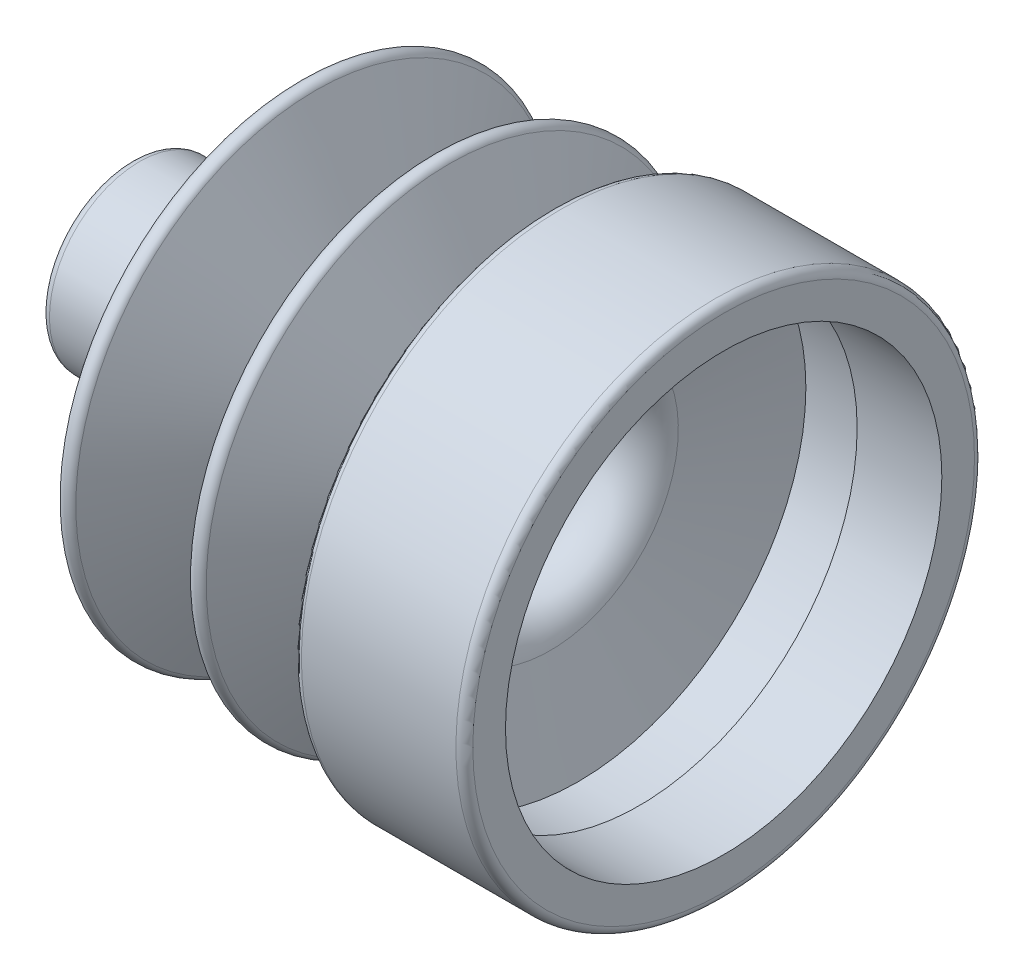
ISO-10303-21;
HEADER;
FILE_DESCRIPTION(('STEP AP214'),'2;1');
FILE_NAME('part.step','',(''),(''),'','','');
FILE_SCHEMA(('AUTOMOTIVE_DESIGN { 1 0 10303 214 1 1 1 1 }'));
ENDSEC;
DATA;
#1=APPLICATION_CONTEXT('core data for automotive mechanical design processes');
#2=APPLICATION_PROTOCOL_DEFINITION('international standard','automotive_design',2000,#1);
#3=PRODUCT_CONTEXT('',#1,'mechanical');
#4=PRODUCT('Part','Part','',(#3));
#5=PRODUCT_RELATED_PRODUCT_CATEGORY('part','',(#4));
#6=PRODUCT_DEFINITION_FORMATION('','',#4);
#7=PRODUCT_DEFINITION_CONTEXT('part definition',#1,'design');
#8=PRODUCT_DEFINITION('design','',#6,#7);
#9=PRODUCT_DEFINITION_SHAPE('','',#8);
#10=(LENGTH_UNIT() NAMED_UNIT(*) SI_UNIT(.MILLI.,.METRE.));
#11=(NAMED_UNIT(*) PLANE_ANGLE_UNIT() SI_UNIT($,.RADIAN.));
#12=(NAMED_UNIT(*) SI_UNIT($,.STERADIAN.) SOLID_ANGLE_UNIT());
#13=UNCERTAINTY_MEASURE_WITH_UNIT(LENGTH_MEASURE(1.E-05),#10,'distance_accuracy_value','');
#14=(GEOMETRIC_REPRESENTATION_CONTEXT(3) GLOBAL_UNCERTAINTY_ASSIGNED_CONTEXT((#13)) GLOBAL_UNIT_ASSIGNED_CONTEXT((#10,
#11,#12)) REPRESENTATION_CONTEXT('',''));
#15=CARTESIAN_POINT('',(0.,0.,0.));
#16=DIRECTION('',(0.,0.,1.));
#17=DIRECTION('',(1.,0.,0.));
#18=AXIS2_PLACEMENT_3D('',#15,#16,#17);
#19=CARTESIAN_POINT('',(-44.45,6.111875,0.));
#20=DIRECTION('',(-1.,0.,0.));
#21=DIRECTION('',(0.,-1.,0.));
#22=AXIS2_PLACEMENT_3D('',#19,#20,#21);
#23=PLANE('',#22);
#24=CARTESIAN_POINT('',(-44.45,0.,0.));
#25=DIRECTION('',(-1.,0.,0.));
#26=DIRECTION('',(0.,-1.,0.));
#27=AXIS2_PLACEMENT_3D('',#24,#25,#26);
#28=CIRCLE('',#27,3.96875);
#29=CARTESIAN_POINT('',(-44.45,-3.96875,0.));
#30=VERTEX_POINT('',#29);
#31=EDGE_CURVE('E132',#30,#30,#28,.T.);
#32=ORIENTED_EDGE('',*,*,#31,.F.);
#33=EDGE_LOOP('',(#32));
#34=FACE_BOUND('',#33,.T.);
#35=CARTESIAN_POINT('',(-44.45,0.,0.));
#36=DIRECTION('',(1.,0.,0.));
#37=DIRECTION('',(0.,1.,0.));
#38=AXIS2_PLACEMENT_3D('',#35,#36,#37);
#39=CIRCLE('',#38,6.111875);
#40=CARTESIAN_POINT('',(-44.45,6.111875,0.));
#41=VERTEX_POINT('',#40);
#42=EDGE_CURVE('E41',#41,#41,#39,.T.);
#43=ORIENTED_EDGE('',*,*,#42,.F.);
#44=EDGE_LOOP('',(#43));
#45=FACE_BOUND('',#44,.T.);
#46=ADVANCED_FACE('F35',(#34,#45),#23,.T.);
#47=CARTESIAN_POINT('',(-43.815,0.,0.));
#48=DIRECTION('',(1.,0.,0.));
#49=DIRECTION('',(0.,1.,0.));
#50=AXIS2_PLACEMENT_3D('',#47,#48,#49);
#51=TOROIDAL_SURFACE('',#50,6.111875,0.634999999999999);
#52=ORIENTED_EDGE('',*,*,#42,.T.);
#53=EDGE_LOOP('',(#52));
#54=FACE_BOUND('',#53,.T.);
#55=CARTESIAN_POINT('',(-43.815,0.,0.));
#56=DIRECTION('',(1.,0.,0.));
#57=DIRECTION('',(0.,1.,0.));
#58=AXIS2_PLACEMENT_3D('',#55,#56,#57);
#59=CIRCLE('',#58,6.746875);
#60=CARTESIAN_POINT('',(-43.815,6.746875,0.));
#61=VERTEX_POINT('',#60);
#62=EDGE_CURVE('E45',#61,#61,#59,.T.);
#63=ORIENTED_EDGE('',*,*,#62,.F.);
#64=EDGE_LOOP('',(#63));
#65=FACE_BOUND('',#64,.T.);
#66=ADVANCED_FACE('F141',(#54,#65),#51,.T.);
#67=CARTESIAN_POINT('',(0.,0.,0.));
#68=DIRECTION('',(1.,0.,0.));
#69=DIRECTION('',(0.,1.,0.));
#70=AXIS2_PLACEMENT_3D('',#67,#68,#69);
#71=CYLINDRICAL_SURFACE('',#70,6.746875);
#72=ORIENTED_EDGE('',*,*,#62,.T.);
#73=EDGE_LOOP('',(#72));
#74=FACE_BOUND('',#73,.T.);
#75=CARTESIAN_POINT('',(-35.4052001738296,0.,0.));
#76=DIRECTION('',(1.,0.,0.));
#77=DIRECTION('',(0.,1.,0.));
#78=AXIS2_PLACEMENT_3D('',#75,#76,#77);
#79=CIRCLE('',#78,6.746875);
#80=CARTESIAN_POINT('',(-35.4052001738296,6.746875,0.));
#81=VERTEX_POINT('',#80);
#82=EDGE_CURVE('E49',#81,#81,#79,.T.);
#83=ORIENTED_EDGE('',*,*,#82,.F.);
#84=EDGE_LOOP('',(#83));
#85=FACE_BOUND('',#84,.T.);
#86=ADVANCED_FACE('F147',(#74,#85),#71,.T.);
#87=CARTESIAN_POINT('',(-35.4052001738296,0.,0.));
#88=DIRECTION('',(1.,0.,0.));
#89=DIRECTION('',(0.,1.,0.));
#90=AXIS2_PLACEMENT_3D('',#87,#88,#89);
#91=TOROIDAL_SURFACE('',#90,7.381875,0.635000000000003);
#92=ORIENTED_EDGE('',*,*,#82,.T.);
#93=EDGE_LOOP('',(#92));
#94=FACE_BOUND('',#93,.T.);
#95=CARTESIAN_POINT('',(-34.7942078783524,0.,0.));
#96=DIRECTION('',(1.,0.,0.));
#97=DIRECTION('',(0.,1.,0.));
#98=AXIS2_PLACEMENT_3D('',#95,#96,#97);
#99=CIRCLE('',#98,7.20892004960113);
#100=CARTESIAN_POINT('',(-34.7942078783524,7.20892004960113,0.));
#101=VERTEX_POINT('',#100);
#102=EDGE_CURVE('E54',#101,#101,#99,.T.);
#103=ORIENTED_EDGE('',*,*,#102,.F.);
#104=EDGE_LOOP('',(#103));
#105=FACE_BOUND('',#104,.T.);
#106=ADVANCED_FACE('F151',(#94,#105),#91,.F.);
#107=CARTESIAN_POINT('',(-31.7742982560787,0.,0.));
#108=DIRECTION('',(1.,0.,0.));
#109=DIRECTION('',(0.,1.,0.));
#110=AXIS2_PLACEMENT_3D('',#107,#108,#109);
#111=CONICAL_SURFACE('',#110,17.8772559832736,1.2949410259382);
#112=ORIENTED_EDGE('',*,*,#102,.T.);
#113=EDGE_LOOP('',(#112));
#114=FACE_BOUND('',#113,.T.);
#115=CARTESIAN_POINT('',(-31.7742982560787,0.,0.));
#116=DIRECTION('',(1.,0.,0.));
#117=DIRECTION('',(0.,1.,0.));
#118=AXIS2_PLACEMENT_3D('',#115,#116,#117);
#119=CIRCLE('',#118,17.8772559832736);
#120=CARTESIAN_POINT('',(-31.7742982560787,17.8772559832736,0.));
#121=VERTEX_POINT('',#120);
#122=EDGE_CURVE('E57',#121,#121,#119,.T.);
#123=ORIENTED_EDGE('',*,*,#122,.F.);
#124=EDGE_LOOP('',(#123));
#125=FACE_BOUND('',#124,.T.);
#126=ADVANCED_FACE('F158',(#114,#125),#111,.T.);
#127=CARTESIAN_POINT('',(-31.1633059606015,0.,0.));
#128=DIRECTION('',(1.,0.,0.));
#129=DIRECTION('',(0.,1.,0.));
#130=AXIS2_PLACEMENT_3D('',#127,#128,#129);
#131=TOROIDAL_SURFACE('',#130,17.7043010328748,0.634999999999999);
#132=ORIENTED_EDGE('',*,*,#122,.T.);
#133=EDGE_LOOP('',(#132));
#134=FACE_BOUND('',#133,.T.);
#135=CARTESIAN_POINT('',(-30.5961783253455,0.,0.));
#136=DIRECTION('',(1.,0.,0.));
#137=DIRECTION('',(0.,1.,0.));
#138=AXIS2_PLACEMENT_3D('',#135,#136,#137);
#139=CIRCLE('',#138,17.9899428458659);
#140=CARTESIAN_POINT('',(-30.5961783253455,17.9899428458659,0.));
#141=VERTEX_POINT('',#140);
#142=EDGE_CURVE('E60',#141,#141,#139,.T.);
#143=ORIENTED_EDGE('',*,*,#142,.F.);
#144=EDGE_LOOP('',(#143));
#145=FACE_BOUND('',#144,.T.);
#146=ADVANCED_FACE('F162',(#134,#145),#131,.T.);
#147=CARTESIAN_POINT('',(-26.5166095683057,0.,0.));
#148=DIRECTION('',(-1.,0.,0.));
#149=DIRECTION('',(0.,-1.,0.));
#150=AXIS2_PLACEMENT_3D('',#147,#148,#149);
#151=CONICAL_SURFACE('',#150,9.89016166251453,1.104221759984);
#152=ORIENTED_EDGE('',*,*,#142,.T.);
#153=EDGE_LOOP('',(#152));
#154=FACE_BOUND('',#153,.T.);
#155=CARTESIAN_POINT('',(-26.5166095683057,0.,0.));
#156=DIRECTION('',(1.,0.,0.));
#157=DIRECTION('',(0.,1.,0.));
#158=AXIS2_PLACEMENT_3D('',#155,#156,#157);
#159=CIRCLE('',#158,9.89016166251453);
#160=CARTESIAN_POINT('',(-26.5166095683057,9.89016166251453,0.));
#161=VERTEX_POINT('',#160);
#162=EDGE_CURVE('E63',#161,#161,#159,.T.);
#163=ORIENTED_EDGE('',*,*,#162,.F.);
#164=EDGE_LOOP('',(#163));
#165=FACE_BOUND('',#164,.T.);
#166=ADVANCED_FACE('F166',(#154,#165),#151,.T.);
#167=CARTESIAN_POINT('',(-25.9494819330497,0.,0.));
#168=DIRECTION('',(1.,0.,0.));
#169=DIRECTION('',(0.,1.,0.));
#170=AXIS2_PLACEMENT_3D('',#167,#168,#169);
#171=TOROIDAL_SURFACE('',#170,10.1758034755057,0.634999999999999);
#172=ORIENTED_EDGE('',*,*,#162,.T.);
#173=EDGE_LOOP('',(#172));
#174=FACE_BOUND('',#173,.T.);
#175=CARTESIAN_POINT('',(-25.3685451990316,0.,0.));
#176=DIRECTION('',(1.,0.,0.));
#177=DIRECTION('',(0.,1.,0.));
#178=AXIS2_PLACEMENT_3D('',#175,#176,#177);
#179=CIRCLE('',#178,9.91941020127948);
#180=CARTESIAN_POINT('',(-25.3685451990316,9.91941020127948,0.));
#181=VERTEX_POINT('',#180);
#182=EDGE_CURVE('E66',#181,#181,#179,.T.);
#183=ORIENTED_EDGE('',*,*,#182,.F.);
#184=EDGE_LOOP('',(#183));
#185=FACE_BOUND('',#184,.T.);
#186=ADVANCED_FACE('F170',(#174,#185),#171,.F.);
#187=CARTESIAN_POINT('',(-21.7067073886102,0.,0.));
#188=DIRECTION('',(1.,0.,0.));
#189=DIRECTION('',(0.,1.,0.));
#190=AXIS2_PLACEMENT_3D('',#187,#188,#189);
#191=CONICAL_SURFACE('',#190,18.2164144987206,1.15516352618213);
#192=ORIENTED_EDGE('',*,*,#182,.T.);
#193=EDGE_LOOP('',(#192));
#194=FACE_BOUND('',#193,.T.);
#195=CARTESIAN_POINT('',(-21.7067073886102,0.,0.));
#196=DIRECTION('',(1.,0.,0.));
#197=DIRECTION('',(0.,1.,0.));
#198=AXIS2_PLACEMENT_3D('',#195,#196,#197);
#199=CIRCLE('',#198,18.2164144987206);
#200=CARTESIAN_POINT('',(-21.7067073886102,18.2164144987206,0.));
#201=VERTEX_POINT('',#200);
#202=EDGE_CURVE('E69',#201,#201,#199,.T.);
#203=ORIENTED_EDGE('',*,*,#202,.F.);
#204=EDGE_LOOP('',(#203));
#205=FACE_BOUND('',#204,.T.);
#206=ADVANCED_FACE('F174',(#194,#205),#191,.T.);
#207=CARTESIAN_POINT('',(-21.1257706545921,0.,0.));
#208=DIRECTION('',(1.,0.,0.));
#209=DIRECTION('',(0.,1.,0.));
#210=AXIS2_PLACEMENT_3D('',#207,#208,#209);
#211=TOROIDAL_SURFACE('',#210,17.9600212244944,0.634999999999999);
#212=ORIENTED_EDGE('',*,*,#202,.T.);
#213=EDGE_LOOP('',(#212));
#214=FACE_BOUND('',#213,.T.);
#215=CARTESIAN_POINT('',(-20.5586430193361,0.,0.));
#216=DIRECTION('',(1.,0.,0.));
#217=DIRECTION('',(0.,1.,0.));
#218=AXIS2_PLACEMENT_3D('',#215,#216,#217);
#219=CIRCLE('',#218,18.2456630374855);
#220=CARTESIAN_POINT('',(-20.5586430193361,18.2456630374855,0.));
#221=VERTEX_POINT('',#220);
#222=EDGE_CURVE('E72',#221,#221,#219,.T.);
#223=ORIENTED_EDGE('',*,*,#222,.F.);
#224=EDGE_LOOP('',(#223));
#225=FACE_BOUND('',#224,.T.);
#226=ADVANCED_FACE('F178',(#214,#225),#211,.T.);
#227=CARTESIAN_POINT('',(-16.4790742622963,0.,0.));
#228=DIRECTION('',(-1.,0.,0.));
#229=DIRECTION('',(0.,-1.,0.));
#230=AXIS2_PLACEMENT_3D('',#227,#228,#229);
#231=CONICAL_SURFACE('',#230,10.1458818541341,1.104221759984);
#232=ORIENTED_EDGE('',*,*,#222,.T.);
#233=EDGE_LOOP('',(#232));
#234=FACE_BOUND('',#233,.T.);
#235=CARTESIAN_POINT('',(-16.4790742622963,0.,0.));
#236=DIRECTION('',(1.,0.,0.));
#237=DIRECTION('',(0.,1.,0.));
#238=AXIS2_PLACEMENT_3D('',#235,#236,#237);
#239=CIRCLE('',#238,10.1458818541341);
#240=CARTESIAN_POINT('',(-16.4790742622963,10.1458818541341,0.));
#241=VERTEX_POINT('',#240);
#242=EDGE_CURVE('E75',#241,#241,#239,.T.);
#243=ORIENTED_EDGE('',*,*,#242,.F.);
#244=EDGE_LOOP('',(#243));
#245=FACE_BOUND('',#244,.T.);
#246=ADVANCED_FACE('F182',(#234,#245),#231,.T.);
#247=CARTESIAN_POINT('',(-15.9119466270403,0.,0.));
#248=DIRECTION('',(1.,0.,0.));
#249=DIRECTION('',(0.,1.,0.));
#250=AXIS2_PLACEMENT_3D('',#247,#248,#249);
#251=TOROIDAL_SURFACE('',#250,10.4315236671253,0.635);
#252=ORIENTED_EDGE('',*,*,#242,.T.);
#253=EDGE_LOOP('',(#252));
#254=FACE_BOUND('',#253,.T.);
#255=CARTESIAN_POINT('',(-15.3009543315631,0.,0.));
#256=DIRECTION('',(1.,0.,0.));
#257=DIRECTION('',(0.,1.,0.));
#258=AXIS2_PLACEMENT_3D('',#255,#256,#257);
#259=CIRCLE('',#258,10.2585687167264);
#260=CARTESIAN_POINT('',(-15.3009543315631,10.2585687167264,0.));
#261=VERTEX_POINT('',#260);
#262=EDGE_CURVE('E78',#261,#261,#259,.T.);
#263=ORIENTED_EDGE('',*,*,#262,.F.);
#264=EDGE_LOOP('',(#263));
#265=FACE_BOUND('',#264,.T.);
#266=ADVANCED_FACE('F186',(#254,#265),#251,.F.);
#267=CARTESIAN_POINT('',(-12.8307921216476,0.,0.));
#268=DIRECTION('',(1.,0.,0.));
#269=DIRECTION('',(0.,1.,0.));
#270=AXIS2_PLACEMENT_3D('',#267,#268,#269);
#271=CONICAL_SURFACE('',#270,18.9848299503989,1.2949410259382);
#272=ORIENTED_EDGE('',*,*,#262,.T.);
#273=EDGE_LOOP('',(#272));
#274=FACE_BOUND('',#273,.T.);
#275=CARTESIAN_POINT('',(-12.8307921216476,0.,0.));
#276=DIRECTION('',(1.,0.,0.));
#277=DIRECTION('',(0.,1.,0.));
#278=AXIS2_PLACEMENT_3D('',#275,#276,#277);
#279=CIRCLE('',#278,18.9848299503989);
#280=CARTESIAN_POINT('',(-12.8307921216476,18.9848299503989,0.));
#281=VERTEX_POINT('',#280);
#282=EDGE_CURVE('E81',#281,#281,#279,.T.);
#283=ORIENTED_EDGE('',*,*,#282,.F.);
#284=EDGE_LOOP('',(#283));
#285=FACE_BOUND('',#284,.T.);
#286=ADVANCED_FACE('F190',(#274,#285),#271,.T.);
#287=CARTESIAN_POINT('',(-12.2197998261704,0.,0.));
#288=DIRECTION('',(1.,0.,0.));
#289=DIRECTION('',(0.,1.,0.));
#290=AXIS2_PLACEMENT_3D('',#287,#288,#289);
#291=TOROIDAL_SURFACE('',#290,18.811875,0.635);
#292=ORIENTED_EDGE('',*,*,#282,.T.);
#293=EDGE_LOOP('',(#292));
#294=FACE_BOUND('',#293,.T.);
#295=CARTESIAN_POINT('',(-12.2197998261704,0.,0.));
#296=DIRECTION('',(1.,0.,0.));
#297=DIRECTION('',(0.,1.,0.));
#298=AXIS2_PLACEMENT_3D('',#295,#296,#297);
#299=CIRCLE('',#298,19.446875);
#300=CARTESIAN_POINT('',(-12.2197998261704,19.446875,0.));
#301=VERTEX_POINT('',#300);
#302=EDGE_CURVE('E84',#301,#301,#299,.T.);
#303=ORIENTED_EDGE('',*,*,#302,.F.);
#304=EDGE_LOOP('',(#303));
#305=FACE_BOUND('',#304,.T.);
#306=ADVANCED_FACE('F194',(#294,#305),#291,.T.);
#307=CARTESIAN_POINT('',(0.,0.,0.));
#308=DIRECTION('',(1.,0.,0.));
#309=DIRECTION('',(0.,1.,0.));
#310=AXIS2_PLACEMENT_3D('',#307,#308,#309);
#311=CYLINDRICAL_SURFACE('',#310,19.446875);
#312=ORIENTED_EDGE('',*,*,#302,.T.);
#313=EDGE_LOOP('',(#312));
#314=FACE_BOUND('',#313,.T.);
#315=CARTESIAN_POINT('',(-0.635000000000004,0.,0.));
#316=DIRECTION('',(1.,0.,0.));
#317=DIRECTION('',(0.,1.,0.));
#318=AXIS2_PLACEMENT_3D('',#315,#316,#317);
#319=CIRCLE('',#318,19.446875);
#320=CARTESIAN_POINT('',(-0.635000000000004,19.446875,0.));
#321=VERTEX_POINT('',#320);
#322=EDGE_CURVE('E87',#321,#321,#319,.T.);
#323=ORIENTED_EDGE('',*,*,#322,.F.);
#324=EDGE_LOOP('',(#323));
#325=FACE_BOUND('',#324,.T.);
#326=ADVANCED_FACE('F198',(#314,#325),#311,.T.);
#327=CARTESIAN_POINT('',(-0.635,0.,0.));
#328=DIRECTION('',(1.,0.,0.));
#329=DIRECTION('',(0.,1.,0.));
#330=AXIS2_PLACEMENT_3D('',#327,#328,#329);
#331=TOROIDAL_SURFACE('',#330,18.811875,0.635);
#332=ORIENTED_EDGE('',*,*,#322,.T.);
#333=EDGE_LOOP('',(#332));
#334=FACE_BOUND('',#333,.T.);
#335=CARTESIAN_POINT('',(0.,0.,0.));
#336=DIRECTION('',(1.,0.,0.));
#337=DIRECTION('',(0.,1.,0.));
#338=AXIS2_PLACEMENT_3D('',#335,#336,#337);
#339=CIRCLE('',#338,18.811875);
#340=CARTESIAN_POINT('',(0.,18.811875,0.));
#341=VERTEX_POINT('',#340);
#342=EDGE_CURVE('E90',#341,#341,#339,.T.);
#343=ORIENTED_EDGE('',*,*,#342,.F.);
#344=EDGE_LOOP('',(#343));
#345=FACE_BOUND('',#344,.T.);
#346=ADVANCED_FACE('F202',(#334,#345),#331,.T.);
#347=CARTESIAN_POINT('',(0.,0.,0.));
#348=DIRECTION('',(1.,0.,0.));
#349=DIRECTION('',(0.,1.,0.));
#350=AXIS2_PLACEMENT_3D('',#347,#348,#349);
#351=PLANE('',#350);
#352=CARTESIAN_POINT('',(0.,0.,0.));
#353=DIRECTION('',(-1.,0.,0.));
#354=DIRECTION('',(0.,0.,1.));
#355=AXIS2_PLACEMENT_3D('',#352,#353,#354);
#356=CIRCLE('',#355,16.3626239198968);
#357=CARTESIAN_POINT('',(0.,0.,16.3626239198968));
#358=VERTEX_POINT('',#357);
#359=EDGE_CURVE('E98',#358,#358,#356,.T.);
#360=ORIENTED_EDGE('',*,*,#359,.T.);
#361=EDGE_LOOP('',(#360));
#362=FACE_BOUND('',#361,.T.);
#363=ORIENTED_EDGE('',*,*,#342,.T.);
#364=EDGE_LOOP('',(#363));
#365=FACE_BOUND('',#364,.T.);
#366=ADVANCED_FACE('F206',(#362,#365),#351,.T.);
#367=CARTESIAN_POINT('',(-6.35,17.1563739198968,0.));
#368=DIRECTION('',(1.,0.,0.));
#369=DIRECTION('',(0.,0.,-1.));
#370=AXIS2_PLACEMENT_3D('',#367,#368,#369);
#371=PLANE('',#370);
#372=CARTESIAN_POINT('',(-6.35,0.,0.));
#373=DIRECTION('',(-1.,0.,0.));
#374=DIRECTION('',(0.,0.,1.));
#375=AXIS2_PLACEMENT_3D('',#372,#373,#374);
#376=CIRCLE('',#375,16.3626239198968);
#377=CARTESIAN_POINT('',(-6.35,0.,16.3626239198968));
#378=VERTEX_POINT('',#377);
#379=EDGE_CURVE('E126',#378,#378,#376,.T.);
#380=ORIENTED_EDGE('',*,*,#379,.F.);
#381=EDGE_LOOP('',(#380));
#382=FACE_BOUND('',#381,.T.);
#383=CARTESIAN_POINT('',(-6.35,0.,0.));
#384=DIRECTION('',(1.,0.,0.));
#385=DIRECTION('',(0.,0.,-1.));
#386=AXIS2_PLACEMENT_3D('',#383,#384,#385);
#387=CIRCLE('',#386,17.065625);
#388=CARTESIAN_POINT('',(-6.35,0.,-17.065625));
#389=VERTEX_POINT('',#388);
#390=EDGE_CURVE('E10',#389,#389,#387,.F.);
#391=ORIENTED_EDGE('',*,*,#390,.T.);
#392=EDGE_LOOP('',(#391));
#393=FACE_BOUND('',#392,.T.);
#394=ADVANCED_FACE('F210',(#382,#393),#371,.F.);
#395=CARTESIAN_POINT('',(-56.5582404126489,0.,0.));
#396=DIRECTION('',(-1.,0.,0.));
#397=DIRECTION('',(0.,0.,1.));
#398=AXIS2_PLACEMENT_3D('',#395,#396,#397);
#399=CYLINDRICAL_SURFACE('',#398,16.3626239198968);
#400=ORIENTED_EDGE('',*,*,#359,.F.);
#401=EDGE_LOOP('',(#400));
#402=FACE_BOUND('',#401,.T.);
#403=ORIENTED_EDGE('',*,*,#379,.T.);
#404=EDGE_LOOP('',(#403));
#405=FACE_BOUND('',#404,.T.);
#406=ADVANCED_FACE('F253',(#402,#405),#399,.F.);
#407=CARTESIAN_POINT('',(-42.06875,6.111875,0.));
#408=DIRECTION('',(-1.,0.,0.));
#409=DIRECTION('',(0.,-1.,0.));
#410=AXIS2_PLACEMENT_3D('',#407,#408,#409);
#411=PLANE('',#410);
#412=CARTESIAN_POINT('',(-42.06875,0.,0.));
#413=DIRECTION('',(-1.,0.,0.));
#414=DIRECTION('',(0.,-1.,0.));
#415=AXIS2_PLACEMENT_3D('',#412,#413,#414);
#416=CIRCLE('',#415,3.96875);
#417=CARTESIAN_POINT('',(-42.06875,-3.96875,0.));
#418=VERTEX_POINT('',#417);
#419=EDGE_CURVE('E129',#418,#418,#416,.F.);
#420=ORIENTED_EDGE('',*,*,#419,.F.);
#421=EDGE_LOOP('',(#420));
#422=FACE_BOUND('',#421,.T.);
#423=CARTESIAN_POINT('',(-42.06875,0.,0.));
#424=DIRECTION('',(-1.,0.,0.));
#425=DIRECTION('',(0.,-1.,0.));
#426=AXIS2_PLACEMENT_3D('',#423,#424,#425);
#427=CIRCLE('',#426,4.365625);
#428=CARTESIAN_POINT('',(-42.06875,-4.365625,0.));
#429=VERTEX_POINT('',#428);
#430=EDGE_CURVE('E93',#429,#429,#427,.F.);
#431=ORIENTED_EDGE('',*,*,#430,.T.);
#432=EDGE_LOOP('',(#431));
#433=FACE_BOUND('',#432,.T.);
#434=ADVANCED_FACE('F250',(#422,#433),#411,.F.);
#435=CARTESIAN_POINT('',(0.,0.,0.));
#436=DIRECTION('',(1.,0.,0.));
#437=DIRECTION('',(0.,1.,0.));
#438=AXIS2_PLACEMENT_3D('',#435,#436,#437);
#439=CYLINDRICAL_SURFACE('',#438,4.365625);
#440=ORIENTED_EDGE('',*,*,#430,.F.);
#441=EDGE_LOOP('',(#440));
#442=FACE_BOUND('',#441,.T.);
#443=CARTESIAN_POINT('',(-35.4052001738296,0.,0.));
#444=DIRECTION('',(1.,0.,0.));
#445=DIRECTION('',(0.,1.,0.));
#446=AXIS2_PLACEMENT_3D('',#443,#444,#445);
#447=CIRCLE('',#446,4.365625);
#448=CARTESIAN_POINT('',(-35.4052001738296,4.365625,0.));
#449=VERTEX_POINT('',#448);
#450=EDGE_CURVE('E119',#449,#449,#447,.T.);
#451=ORIENTED_EDGE('',*,*,#450,.T.);
#452=EDGE_LOOP('',(#451));
#453=FACE_BOUND('',#452,.T.);
#454=ADVANCED_FACE('F246',(#442,#453),#439,.F.);
#455=CARTESIAN_POINT('',(-35.4052001738296,0.,0.));
#456=DIRECTION('',(1.,0.,0.));
#457=DIRECTION('',(0.,1.,0.));
#458=AXIS2_PLACEMENT_3D('',#455,#456,#457);
#459=TOROIDAL_SURFACE('',#458,7.381875,3.01625);
#460=ORIENTED_EDGE('',*,*,#450,.F.);
#461=EDGE_LOOP('',(#460));
#462=FACE_BOUND('',#461,.T.);
#463=CARTESIAN_POINT('',(-32.5029867703128,0.,0.));
#464=DIRECTION('',(1.,0.,0.));
#465=DIRECTION('',(0.,1.,0.));
#466=AXIS2_PLACEMENT_3D('',#463,#464,#465);
#467=CIRCLE('',#466,6.5603389856054);
#468=CARTESIAN_POINT('',(-32.5029867703128,6.5603389856054,0.));
#469=VERTEX_POINT('',#468);
#470=EDGE_CURVE('E116',#469,#469,#467,.T.);
#471=ORIENTED_EDGE('',*,*,#470,.T.);
#472=EDGE_LOOP('',(#471));
#473=FACE_BOUND('',#472,.T.);
#474=ADVANCED_FACE('F242',(#462,#473),#459,.T.);
#475=CARTESIAN_POINT('',(-29.4830771480391,0.,0.));
#476=DIRECTION('',(1.,0.,0.));
#477=DIRECTION('',(0.,1.,0.));
#478=AXIS2_PLACEMENT_3D('',#475,#476,#477);
#479=CONICAL_SURFACE('',#478,17.2286749192779,1.2949410259382);
#480=ORIENTED_EDGE('',*,*,#470,.F.);
#481=EDGE_LOOP('',(#480));
#482=FACE_BOUND('',#481,.T.);
#483=CARTESIAN_POINT('',(-30.7049449167157,0.,0.));
#484=DIRECTION('',(1.,0.,0.));
#485=DIRECTION('',(0.,1.,0.));
#486=AXIS2_PLACEMENT_3D('',#483,#484,#485);
#487=CIRCLE('',#486,12.9122226232804);
#488=CARTESIAN_POINT('',(-30.7049449167157,12.9122226232804,0.));
#489=VERTEX_POINT('',#488);
#490=EDGE_CURVE('E113',#489,#489,#487,.T.);
#491=ORIENTED_EDGE('',*,*,#490,.T.);
#492=EDGE_LOOP('',(#491));
#493=FACE_BOUND('',#492,.T.);
#494=ADVANCED_FACE('F238',(#482,#493),#479,.F.);
#495=CARTESIAN_POINT('',(-28.6433382005159,0.,0.));
#496=DIRECTION('',(-1.,0.,0.));
#497=DIRECTION('',(0.,-1.,0.));
#498=AXIS2_PLACEMENT_3D('',#495,#496,#497);
#499=CONICAL_SURFACE('',#498,8.81900486379759,1.104221759984);
#500=ORIENTED_EDGE('',*,*,#490,.F.);
#501=EDGE_LOOP('',(#500));
#502=FACE_BOUND('',#501,.T.);
#503=CARTESIAN_POINT('',(-28.6433382005159,0.,0.));
#504=DIRECTION('',(1.,0.,0.));
#505=DIRECTION('',(0.,1.,0.));
#506=AXIS2_PLACEMENT_3D('',#503,#504,#505);
#507=CIRCLE('',#506,8.81900486379758);
#508=CARTESIAN_POINT('',(-28.6433382005159,8.81900486379758,0.));
#509=VERTEX_POINT('',#508);
#510=EDGE_CURVE('E110',#509,#509,#507,.T.);
#511=ORIENTED_EDGE('',*,*,#510,.T.);
#512=EDGE_LOOP('',(#511));
#513=FACE_BOUND('',#512,.T.);
#514=ADVANCED_FACE('F234',(#502,#513),#499,.F.);
#515=CARTESIAN_POINT('',(-25.9494819330497,0.,0.));
#516=DIRECTION('',(1.,0.,0.));
#517=DIRECTION('',(0.,1.,0.));
#518=AXIS2_PLACEMENT_3D('',#515,#516,#517);
#519=TOROIDAL_SURFACE('',#518,10.1758034755057,3.01625);
#520=ORIENTED_EDGE('',*,*,#510,.F.);
#521=EDGE_LOOP('',(#520));
#522=FACE_BOUND('',#521,.T.);
#523=CARTESIAN_POINT('',(-23.190032446464,0.,0.));
#524=DIRECTION('',(1.,0.,0.));
#525=DIRECTION('',(0.,1.,0.));
#526=AXIS2_PLACEMENT_3D('',#523,#524,#525);
#527=CIRCLE('',#526,8.95793542293111);
#528=CARTESIAN_POINT('',(-23.190032446464,8.95793542293111,0.));
#529=VERTEX_POINT('',#528);
#530=EDGE_CURVE('E107',#529,#529,#527,.T.);
#531=ORIENTED_EDGE('',*,*,#530,.T.);
#532=EDGE_LOOP('',(#531));
#533=FACE_BOUND('',#532,.T.);
#534=ADVANCED_FACE('F230',(#522,#533),#519,.T.);
#535=CARTESIAN_POINT('',(-19.5281946360425,0.,0.));
#536=DIRECTION('',(1.,0.,0.));
#537=DIRECTION('',(0.,1.,0.));
#538=AXIS2_PLACEMENT_3D('',#535,#536,#537);
#539=CONICAL_SURFACE('',#538,17.2549397203722,1.15516352618213);
#540=ORIENTED_EDGE('',*,*,#530,.F.);
#541=EDGE_LOOP('',(#540));
#542=FACE_BOUND('',#541,.T.);
#543=CARTESIAN_POINT('',(-21.0216015600709,0.,0.));
#544=DIRECTION('',(1.,0.,0.));
#545=DIRECTION('',(0.,1.,0.));
#546=AXIS2_PLACEMENT_3D('',#543,#544,#545);
#547=CIRCLE('',#546,13.8711733418538);
#548=CARTESIAN_POINT('',(-21.0216015600709,13.8711733418538,0.));
#549=VERTEX_POINT('',#548);
#550=EDGE_CURVE('E104',#549,#549,#547,.T.);
#551=ORIENTED_EDGE('',*,*,#550,.T.);
#552=EDGE_LOOP('',(#551));
#553=FACE_BOUND('',#552,.T.);
#554=ADVANCED_FACE('F226',(#542,#553),#539,.F.);
#555=CARTESIAN_POINT('',(-18.6058028945065,0.,0.));
#556=DIRECTION('',(-1.,0.,0.));
#557=DIRECTION('',(0.,-1.,0.));
#558=AXIS2_PLACEMENT_3D('',#555,#556,#557);
#559=CONICAL_SURFACE('',#558,9.07472505541718,1.104221759984);
#560=ORIENTED_EDGE('',*,*,#550,.F.);
#561=EDGE_LOOP('',(#560));
#562=FACE_BOUND('',#561,.T.);
#563=CARTESIAN_POINT('',(-18.6058028945065,0.,0.));
#564=DIRECTION('',(1.,0.,0.));
#565=DIRECTION('',(0.,1.,0.));
#566=AXIS2_PLACEMENT_3D('',#563,#564,#565);
#567=CIRCLE('',#566,9.07472505541718);
#568=CARTESIAN_POINT('',(-18.6058028945065,9.07472505541718,0.));
#569=VERTEX_POINT('',#568);
#570=EDGE_CURVE('E101',#569,#569,#567,.T.);
#571=ORIENTED_EDGE('',*,*,#570,.T.);
#572=EDGE_LOOP('',(#571));
#573=FACE_BOUND('',#572,.T.);
#574=ADVANCED_FACE('F222',(#562,#573),#559,.F.);
#575=CARTESIAN_POINT('',(-15.9119466270403,0.,0.));
#576=DIRECTION('',(1.,0.,0.));
#577=DIRECTION('',(0.,1.,0.));
#578=AXIS2_PLACEMENT_3D('',#575,#576,#577);
#579=TOROIDAL_SURFACE('',#578,10.4315236671253,3.01625);
#580=ORIENTED_EDGE('',*,*,#570,.F.);
#581=EDGE_LOOP('',(#580));
#582=FACE_BOUND('',#581,.T.);
#583=CARTESIAN_POINT('',(-13.0097332235235,0.,0.));
#584=DIRECTION('',(1.,0.,0.));
#585=DIRECTION('',(0.,1.,0.));
#586=AXIS2_PLACEMENT_3D('',#583,#584,#585);
#587=CIRCLE('',#586,9.6099876527307);
#588=CARTESIAN_POINT('',(-13.0097332235235,9.6099876527307,0.));
#589=VERTEX_POINT('',#588);
#590=EDGE_CURVE('E97',#589,#589,#587,.T.);
#591=ORIENTED_EDGE('',*,*,#590,.T.);
#592=EDGE_LOOP('',(#591));
#593=FACE_BOUND('',#592,.T.);
#594=ADVANCED_FACE('F218',(#582,#593),#579,.T.);
#595=CARTESIAN_POINT('',(-10.539571013608,0.,0.));
#596=DIRECTION('',(1.,0.,0.));
#597=DIRECTION('',(0.,1.,0.));
#598=AXIS2_PLACEMENT_3D('',#595,#596,#597);
#599=CONICAL_SURFACE('',#598,18.3362488864031,1.2949410259382);
#600=ORIENTED_EDGE('',*,*,#590,.F.);
#601=EDGE_LOOP('',(#600));
#602=FACE_BOUND('',#601,.T.);
#603=CARTESIAN_POINT('',(-10.8992493481389,0.,0.));
#604=DIRECTION('',(1.,0.,0.));
#605=DIRECTION('',(0.,1.,0.));
#606=AXIS2_PLACEMENT_3D('',#603,#604,#605);
#607=CIRCLE('',#606,17.065625);
#608=CARTESIAN_POINT('',(-10.8992493481389,17.065625,0.));
#609=VERTEX_POINT('',#608);
#610=EDGE_CURVE('E94',#609,#609,#607,.T.);
#611=ORIENTED_EDGE('',*,*,#610,.T.);
#612=EDGE_LOOP('',(#611));
#613=FACE_BOUND('',#612,.T.);
#614=ADVANCED_FACE('F214',(#602,#613),#599,.F.);
#615=CARTESIAN_POINT('',(0.,0.,0.));
#616=DIRECTION('',(1.,0.,0.));
#617=DIRECTION('',(0.,1.,0.));
#618=AXIS2_PLACEMENT_3D('',#615,#616,#617);
#619=CYLINDRICAL_SURFACE('',#618,17.065625);
#620=ORIENTED_EDGE('',*,*,#610,.F.);
#621=EDGE_LOOP('',(#620));
#622=FACE_BOUND('',#621,.T.);
#623=ORIENTED_EDGE('',*,*,#390,.F.);
#624=EDGE_LOOP('',(#623));
#625=FACE_BOUND('',#624,.T.);
#626=ADVANCED_FACE('F212',(#622,#625),#619,.F.);
#627=CARTESIAN_POINT('',(0.001000000000001,0.,0.));
#628=DIRECTION('',(-1.,0.,0.));
#629=DIRECTION('',(0.,-1.,0.));
#630=AXIS2_PLACEMENT_3D('',#627,#628,#629);
#631=CYLINDRICAL_SURFACE('',#630,3.96875);
#632=ORIENTED_EDGE('',*,*,#31,.T.);
#633=EDGE_LOOP('',(#632));
#634=FACE_BOUND('',#633,.T.);
#635=ORIENTED_EDGE('',*,*,#419,.T.);
#636=EDGE_LOOP('',(#635));
#637=FACE_BOUND('',#636,.T.);
#638=ADVANCED_FACE('F136',(#634,#637),#631,.F.);
#639=CLOSED_SHELL('',(#46,#66,#86,#106,#126,#146,#166,#186,#206,#226,#246,#266,#286,#306,#326,
#346,#366,#394,#406,#434,#454,#474,#494,#514,#534,#554,#574,#594,#614,#626,#638));
#640=MANIFOLD_SOLID_BREP('B2',#639);
#641=ADVANCED_BREP_SHAPE_REPRESENTATION('',(#18,#640),#14);
#642=SHAPE_DEFINITION_REPRESENTATION(#9,#641);
ENDSEC;
END-ISO-10303-21;
